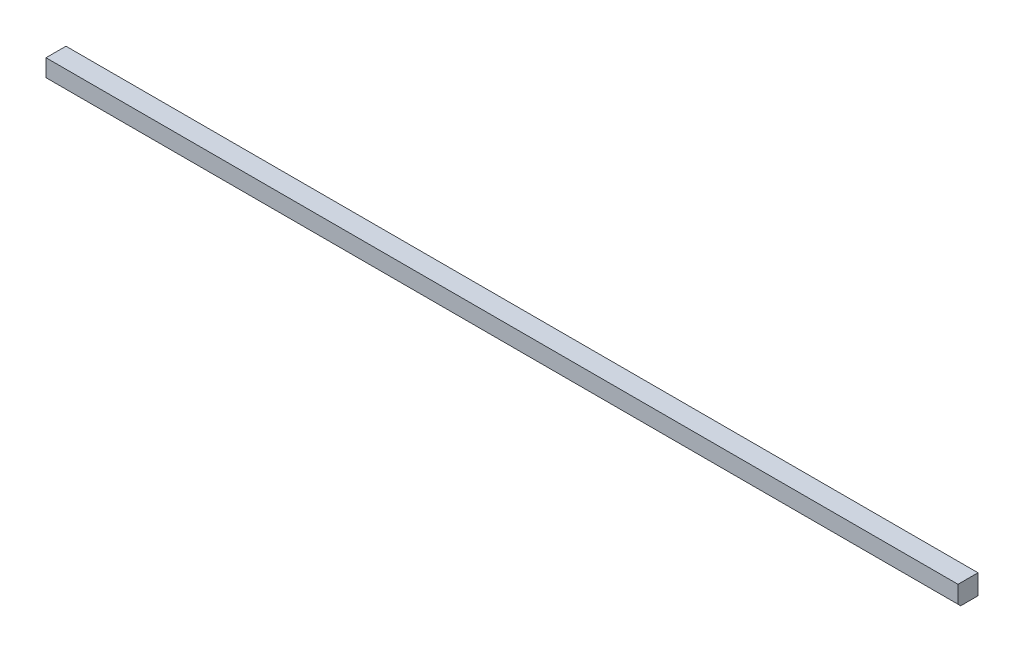
ISO-10303-21;
HEADER;
FILE_DESCRIPTION(('STEP AP214'),'2;1');
FILE_NAME('part.step','',(''),(''),'','','');
FILE_SCHEMA(('AUTOMOTIVE_DESIGN { 1 0 10303 214 1 1 1 1 }'));
ENDSEC;
DATA;
#1=APPLICATION_CONTEXT('core data for automotive mechanical design processes');
#2=APPLICATION_PROTOCOL_DEFINITION('international standard','automotive_design',2000,#1);
#3=PRODUCT_CONTEXT('',#1,'mechanical');
#4=PRODUCT('Part','Part','',(#3));
#5=PRODUCT_RELATED_PRODUCT_CATEGORY('part','',(#4));
#6=PRODUCT_DEFINITION_FORMATION('','',#4);
#7=PRODUCT_DEFINITION_CONTEXT('part definition',#1,'design');
#8=PRODUCT_DEFINITION('design','',#6,#7);
#9=PRODUCT_DEFINITION_SHAPE('','',#8);
#10=(LENGTH_UNIT() NAMED_UNIT(*) SI_UNIT(.MILLI.,.METRE.));
#11=(NAMED_UNIT(*) PLANE_ANGLE_UNIT() SI_UNIT($,.RADIAN.));
#12=(NAMED_UNIT(*) SI_UNIT($,.STERADIAN.) SOLID_ANGLE_UNIT());
#13=UNCERTAINTY_MEASURE_WITH_UNIT(LENGTH_MEASURE(1.E-05),#10,'distance_accuracy_value','');
#14=(GEOMETRIC_REPRESENTATION_CONTEXT(3) GLOBAL_UNCERTAINTY_ASSIGNED_CONTEXT((#13)) GLOBAL_UNIT_ASSIGNED_CONTEXT((#10,
#11,#12)) REPRESENTATION_CONTEXT('',''));
#15=CARTESIAN_POINT('',(0.,0.,0.));
#16=DIRECTION('',(0.,0.,1.));
#17=DIRECTION('',(1.,0.,0.));
#18=AXIS2_PLACEMENT_3D('',#15,#16,#17);
#19=CARTESIAN_POINT('',(0.,19.05,0.));
#20=DIRECTION('',(1.,0.,0.));
#21=DIRECTION('',(0.,0.,-1.));
#22=AXIS2_PLACEMENT_3D('',#19,#20,#21);
#23=PLANE('',#22);
#24=DIRECTION('',(0.,0.,1.));
#25=VECTOR('',#24,1.);
#26=CARTESIAN_POINT('',(0.,0.,0.));
#27=LINE('',#26,#25);
#28=CARTESIAN_POINT('',(0.,0.,-19.05));
#29=VERTEX_POINT('',#28);
#30=CARTESIAN_POINT('',(0.,0.,-2.53999999999998));
#31=VERTEX_POINT('',#30);
#32=EDGE_CURVE('E124',#29,#31,#27,.T.);
#33=ORIENTED_EDGE('',*,*,#32,.T.);
#34=DIRECTION('',(0.,0.707106781186532,0.707106781186563));
#35=VECTOR('',#34,1.);
#36=CARTESIAN_POINT('',(0.,2.53999999999988,0.));
#37=LINE('',#36,#35);
#38=CARTESIAN_POINT('',(0.,2.53999999999988,0.));
#39=VERTEX_POINT('',#38);
#40=EDGE_CURVE('E11',#31,#39,#37,.T.);
#41=ORIENTED_EDGE('',*,*,#40,.T.);
#42=DIRECTION('',(0.,-1.,0.));
#43=VECTOR('',#42,1.);
#44=CARTESIAN_POINT('',(0.,19.05,0.));
#45=LINE('',#44,#43);
#46=CARTESIAN_POINT('',(0.,19.05,0.));
#47=VERTEX_POINT('',#46);
#48=EDGE_CURVE('E92',#47,#39,#45,.T.);
#49=ORIENTED_EDGE('',*,*,#48,.F.);
#50=DIRECTION('',(0.,0.,1.));
#51=VECTOR('',#50,1.);
#52=CARTESIAN_POINT('',(0.,19.05,0.));
#53=LINE('',#52,#51);
#54=CARTESIAN_POINT('',(0.,19.05,-19.05));
#55=VERTEX_POINT('',#54);
#56=EDGE_CURVE('E98',#55,#47,#53,.T.);
#57=ORIENTED_EDGE('',*,*,#56,.F.);
#58=DIRECTION('',(0.,-1.,0.));
#59=VECTOR('',#58,1.);
#60=CARTESIAN_POINT('',(0.,19.05,-19.05));
#61=LINE('',#60,#59);
#62=EDGE_CURVE('E119',#55,#29,#61,.T.);
#63=ORIENTED_EDGE('',*,*,#62,.T.);
#64=EDGE_LOOP('',(#33,#41,#49,#57,#63));
#65=FACE_BOUND('',#64,.T.);
#66=ADVANCED_FACE('F40',(#65),#23,.F.);
#67=CARTESIAN_POINT('',(0.,19.05,0.));
#68=DIRECTION('',(0.,0.,-1.));
#69=DIRECTION('',(-1.,0.,0.));
#70=AXIS2_PLACEMENT_3D('',#67,#68,#69);
#71=PLANE('',#70);
#72=ORIENTED_EDGE('',*,*,#48,.T.);
#73=DIRECTION('',(1.,0.,0.));
#74=VECTOR('',#73,1.);
#75=CARTESIAN_POINT('',(869.95,2.53999999999988,0.));
#76=LINE('',#75,#74);
#77=CARTESIAN_POINT('',(869.95,2.53999999999988,0.));
#78=VERTEX_POINT('',#77);
#79=EDGE_CURVE('E110',#39,#78,#76,.T.);
#80=ORIENTED_EDGE('',*,*,#79,.T.);
#81=DIRECTION('',(0.,-1.,0.));
#82=VECTOR('',#81,1.);
#83=CARTESIAN_POINT('',(869.95,19.05,0.));
#84=LINE('',#83,#82);
#85=CARTESIAN_POINT('',(869.95,19.05,0.));
#86=VERTEX_POINT('',#85);
#87=EDGE_CURVE('E94',#86,#78,#84,.T.);
#88=ORIENTED_EDGE('',*,*,#87,.F.);
#89=DIRECTION('',(1.,0.,0.));
#90=VECTOR('',#89,1.);
#91=CARTESIAN_POINT('',(0.,19.05,0.));
#92=LINE('',#91,#90);
#93=EDGE_CURVE('E87',#47,#86,#92,.T.);
#94=ORIENTED_EDGE('',*,*,#93,.F.);
#95=EDGE_LOOP('',(#72,#80,#88,#94));
#96=FACE_BOUND('',#95,.T.);
#97=ADVANCED_FACE('F89',(#96),#71,.F.);
#98=CARTESIAN_POINT('',(869.95,19.05,0.));
#99=DIRECTION('',(-1.,0.,0.));
#100=DIRECTION('',(0.,0.,1.));
#101=AXIS2_PLACEMENT_3D('',#98,#99,#100);
#102=PLANE('',#101);
#103=ORIENTED_EDGE('',*,*,#87,.T.);
#104=DIRECTION('',(0.,-0.707106781186532,-0.707106781186563));
#105=VECTOR('',#104,1.);
#106=CARTESIAN_POINT('',(869.95,2.53999999999988,0.));
#107=LINE('',#106,#105);
#108=CARTESIAN_POINT('',(869.95,0.,-2.53999999999998));
#109=VERTEX_POINT('',#108);
#110=EDGE_CURVE('E63',#78,#109,#107,.T.);
#111=ORIENTED_EDGE('',*,*,#110,.T.);
#112=DIRECTION('',(0.,0.,-1.));
#113=VECTOR('',#112,1.);
#114=CARTESIAN_POINT('',(869.95,0.,0.));
#115=LINE('',#114,#113);
#116=CARTESIAN_POINT('',(869.95,0.,-19.05));
#117=VERTEX_POINT('',#116);
#118=EDGE_CURVE('E122',#109,#117,#115,.T.);
#119=ORIENTED_EDGE('',*,*,#118,.T.);
#120=DIRECTION('',(0.,-1.,0.));
#121=VECTOR('',#120,1.);
#122=CARTESIAN_POINT('',(869.95,19.05,-19.05));
#123=LINE('',#122,#121);
#124=CARTESIAN_POINT('',(869.95,19.05,-19.05));
#125=VERTEX_POINT('',#124);
#126=EDGE_CURVE('E113',#125,#117,#123,.T.);
#127=ORIENTED_EDGE('',*,*,#126,.F.);
#128=DIRECTION('',(0.,0.,-1.));
#129=VECTOR('',#128,1.);
#130=CARTESIAN_POINT('',(869.95,19.05,0.));
#131=LINE('',#130,#129);
#132=EDGE_CURVE('E97',#86,#125,#131,.T.);
#133=ORIENTED_EDGE('',*,*,#132,.F.);
#134=EDGE_LOOP('',(#103,#111,#119,#127,#133));
#135=FACE_BOUND('',#134,.T.);
#136=ADVANCED_FACE('F128',(#135),#102,.F.);
#137=CARTESIAN_POINT('',(0.,19.05,-19.05));
#138=DIRECTION('',(0.,0.,1.));
#139=DIRECTION('',(1.,0.,0.));
#140=AXIS2_PLACEMENT_3D('',#137,#138,#139);
#141=PLANE('',#140);
#142=DIRECTION('',(-1.,0.,0.));
#143=VECTOR('',#142,1.);
#144=CARTESIAN_POINT('',(0.,0.,-19.05));
#145=LINE('',#144,#143);
#146=EDGE_CURVE('E107',#117,#29,#145,.T.);
#147=ORIENTED_EDGE('',*,*,#146,.T.);
#148=ORIENTED_EDGE('',*,*,#62,.F.);
#149=DIRECTION('',(-1.,0.,0.));
#150=VECTOR('',#149,1.);
#151=CARTESIAN_POINT('',(0.,19.05,-19.05));
#152=LINE('',#151,#150);
#153=EDGE_CURVE('E103',#125,#55,#152,.T.);
#154=ORIENTED_EDGE('',*,*,#153,.F.);
#155=ORIENTED_EDGE('',*,*,#126,.T.);
#156=EDGE_LOOP('',(#147,#148,#154,#155));
#157=FACE_BOUND('',#156,.T.);
#158=ADVANCED_FACE('F131',(#157),#141,.F.);
#159=CARTESIAN_POINT('',(0.,19.05,0.));
#160=DIRECTION('',(0.,-1.,0.));
#161=DIRECTION('',(0.,0.,-1.));
#162=AXIS2_PLACEMENT_3D('',#159,#160,#161);
#163=PLANE('',#162);
#164=ORIENTED_EDGE('',*,*,#56,.T.);
#165=ORIENTED_EDGE('',*,*,#93,.T.);
#166=ORIENTED_EDGE('',*,*,#132,.T.);
#167=ORIENTED_EDGE('',*,*,#153,.T.);
#168=EDGE_LOOP('',(#164,#165,#166,#167));
#169=FACE_BOUND('',#168,.T.);
#170=ADVANCED_FACE('F101',(#169),#163,.F.);
#171=CARTESIAN_POINT('',(0.,0.,0.));
#172=DIRECTION('',(0.,-1.,0.));
#173=DIRECTION('',(0.,0.,-1.));
#174=AXIS2_PLACEMENT_3D('',#171,#172,#173);
#175=PLANE('',#174);
#176=ORIENTED_EDGE('',*,*,#118,.F.);
#177=DIRECTION('',(-1.,0.,0.));
#178=VECTOR('',#177,1.);
#179=CARTESIAN_POINT('',(0.,0.,-2.53999999999999));
#180=LINE('',#179,#178);
#181=EDGE_CURVE('E49',#109,#31,#180,.T.);
#182=ORIENTED_EDGE('',*,*,#181,.T.);
#183=ORIENTED_EDGE('',*,*,#32,.F.);
#184=ORIENTED_EDGE('',*,*,#146,.F.);
#185=EDGE_LOOP('',(#176,#182,#183,#184));
#186=FACE_BOUND('',#185,.T.);
#187=ADVANCED_FACE('F132',(#186),#175,.T.);
#188=CARTESIAN_POINT('',(0.,2.53999999999988,0.));
#189=DIRECTION('',(0.,-0.707106781186563,0.707106781186532));
#190=DIRECTION('',(-1.,0.,0.));
#191=AXIS2_PLACEMENT_3D('',#188,#189,#190);
#192=PLANE('',#191);
#193=ORIENTED_EDGE('',*,*,#40,.F.);
#194=ORIENTED_EDGE('',*,*,#181,.F.);
#195=ORIENTED_EDGE('',*,*,#110,.F.);
#196=ORIENTED_EDGE('',*,*,#79,.F.);
#197=EDGE_LOOP('',(#193,#194,#195,#196));
#198=FACE_BOUND('',#197,.T.);
#199=ADVANCED_FACE('F43',(#198),#192,.T.);
#200=CLOSED_SHELL('',(#66,#97,#136,#158,#170,#187,#199));
#201=MANIFOLD_SOLID_BREP('B2',#200);
#202=ADVANCED_BREP_SHAPE_REPRESENTATION('',(#18,#201),#14);
#203=SHAPE_DEFINITION_REPRESENTATION(#9,#202);
ENDSEC;
END-ISO-10303-21;
